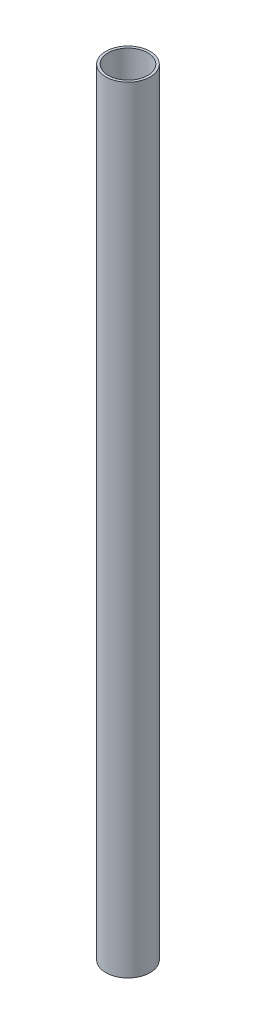
ISO-10303-21;
HEADER;
FILE_DESCRIPTION(('STEP AP214'),'2;1');
FILE_NAME('part.step','',(''),(''),'','','');
FILE_SCHEMA(('AUTOMOTIVE_DESIGN { 1 0 10303 214 1 1 1 1 }'));
ENDSEC;
DATA;
#1=APPLICATION_CONTEXT('core data for automotive mechanical design processes');
#2=APPLICATION_PROTOCOL_DEFINITION('international standard','automotive_design',2000,#1);
#3=PRODUCT_CONTEXT('',#1,'mechanical');
#4=PRODUCT('Part','Part','',(#3));
#5=PRODUCT_RELATED_PRODUCT_CATEGORY('part','',(#4));
#6=PRODUCT_DEFINITION_FORMATION('','',#4);
#7=PRODUCT_DEFINITION_CONTEXT('part definition',#1,'design');
#8=PRODUCT_DEFINITION('design','',#6,#7);
#9=PRODUCT_DEFINITION_SHAPE('','',#8);
#10=(LENGTH_UNIT() NAMED_UNIT(*) SI_UNIT(.MILLI.,.METRE.));
#11=(NAMED_UNIT(*) PLANE_ANGLE_UNIT() SI_UNIT($,.RADIAN.));
#12=(NAMED_UNIT(*) SI_UNIT($,.STERADIAN.) SOLID_ANGLE_UNIT());
#13=UNCERTAINTY_MEASURE_WITH_UNIT(LENGTH_MEASURE(1.E-05),#10,'distance_accuracy_value','');
#14=(GEOMETRIC_REPRESENTATION_CONTEXT(3) GLOBAL_UNCERTAINTY_ASSIGNED_CONTEXT((#13)) GLOBAL_UNIT_ASSIGNED_CONTEXT((#10,
#11,#12)) REPRESENTATION_CONTEXT('',''));
#15=CARTESIAN_POINT('',(0.,0.,0.));
#16=DIRECTION('',(0.,0.,1.));
#17=DIRECTION('',(1.,0.,0.));
#18=AXIS2_PLACEMENT_3D('',#15,#16,#17);
#19=CARTESIAN_POINT('',(0.,315.,0.));
#20=DIRECTION('',(0.,1.,0.));
#21=DIRECTION('',(0.,0.,1.));
#22=AXIS2_PLACEMENT_3D('',#19,#20,#21);
#23=PLANE('',#22);
#24=CARTESIAN_POINT('',(0.,315.,0.));
#25=DIRECTION('',(0.,1.,0.));
#26=DIRECTION('',(0.,0.,1.));
#27=AXIS2_PLACEMENT_3D('',#24,#25,#26);
#28=CIRCLE('',#27,9.);
#29=CARTESIAN_POINT('',(0.,315.,9.));
#30=VERTEX_POINT('',#29);
#31=EDGE_CURVE('E10',#30,#30,#28,.T.);
#32=ORIENTED_EDGE('',*,*,#31,.T.);
#33=EDGE_LOOP('',(#32));
#34=FACE_BOUND('',#33,.T.);
#35=CARTESIAN_POINT('',(0.,315.,0.));
#36=DIRECTION('',(0.,1.,0.));
#37=DIRECTION('',(0.,0.,1.));
#38=AXIS2_PLACEMENT_3D('',#35,#36,#37);
#39=CIRCLE('',#38,8.);
#40=CARTESIAN_POINT('',(0.,315.,8.));
#41=VERTEX_POINT('',#40);
#42=EDGE_CURVE('E42',#41,#41,#39,.T.);
#43=ORIENTED_EDGE('',*,*,#42,.F.);
#44=EDGE_LOOP('',(#43));
#45=FACE_BOUND('',#44,.T.);
#46=ADVANCED_FACE('F31',(#34,#45),#23,.T.);
#47=CARTESIAN_POINT('',(0.,0.,0.));
#48=DIRECTION('',(0.,1.,0.));
#49=DIRECTION('',(0.,0.,1.));
#50=AXIS2_PLACEMENT_3D('',#47,#48,#49);
#51=PLANE('',#50);
#52=CARTESIAN_POINT('',(0.,0.,0.));
#53=DIRECTION('',(0.,1.,0.));
#54=DIRECTION('',(0.,0.,1.));
#55=AXIS2_PLACEMENT_3D('',#52,#53,#54);
#56=CIRCLE('',#55,9.);
#57=CARTESIAN_POINT('',(0.,0.,9.));
#58=VERTEX_POINT('',#57);
#59=EDGE_CURVE('E35',#58,#58,#56,.T.);
#60=ORIENTED_EDGE('',*,*,#59,.F.);
#61=EDGE_LOOP('',(#60));
#62=FACE_BOUND('',#61,.T.);
#63=CARTESIAN_POINT('',(0.,0.,0.));
#64=DIRECTION('',(0.,1.,0.));
#65=DIRECTION('',(0.,0.,1.));
#66=AXIS2_PLACEMENT_3D('',#63,#64,#65);
#67=CIRCLE('',#66,8.);
#68=CARTESIAN_POINT('',(0.,0.,8.));
#69=VERTEX_POINT('',#68);
#70=EDGE_CURVE('E44',#69,#69,#67,.T.);
#71=ORIENTED_EDGE('',*,*,#70,.T.);
#72=EDGE_LOOP('',(#71));
#73=FACE_BOUND('',#72,.T.);
#74=ADVANCED_FACE('F54',(#62,#73),#51,.F.);
#75=CARTESIAN_POINT('',(0.,315.,0.));
#76=DIRECTION('',(0.,-1.,0.));
#77=DIRECTION('',(0.,0.,-1.));
#78=AXIS2_PLACEMENT_3D('',#75,#76,#77);
#79=CYLINDRICAL_SURFACE('',#78,9.);
#80=ORIENTED_EDGE('',*,*,#31,.F.);
#81=EDGE_LOOP('',(#80));
#82=FACE_BOUND('',#81,.T.);
#83=ORIENTED_EDGE('',*,*,#59,.T.);
#84=EDGE_LOOP('',(#83));
#85=FACE_BOUND('',#84,.T.);
#86=ADVANCED_FACE('F33',(#82,#85),#79,.T.);
#87=CARTESIAN_POINT('',(0.,315.,0.));
#88=DIRECTION('',(0.,-1.,0.));
#89=DIRECTION('',(0.,0.,-1.));
#90=AXIS2_PLACEMENT_3D('',#87,#88,#89);
#91=CYLINDRICAL_SURFACE('',#90,8.);
#92=ORIENTED_EDGE('',*,*,#42,.T.);
#93=EDGE_LOOP('',(#92));
#94=FACE_BOUND('',#93,.T.);
#95=ORIENTED_EDGE('',*,*,#70,.F.);
#96=EDGE_LOOP('',(#95));
#97=FACE_BOUND('',#96,.T.);
#98=ADVANCED_FACE('F50',(#94,#97),#91,.F.);
#99=CLOSED_SHELL('',(#46,#74,#86,#98));
#100=MANIFOLD_SOLID_BREP('B2',#99);
#101=ADVANCED_BREP_SHAPE_REPRESENTATION('',(#18,#100),#14);
#102=SHAPE_DEFINITION_REPRESENTATION(#9,#101);
ENDSEC;
END-ISO-10303-21;
